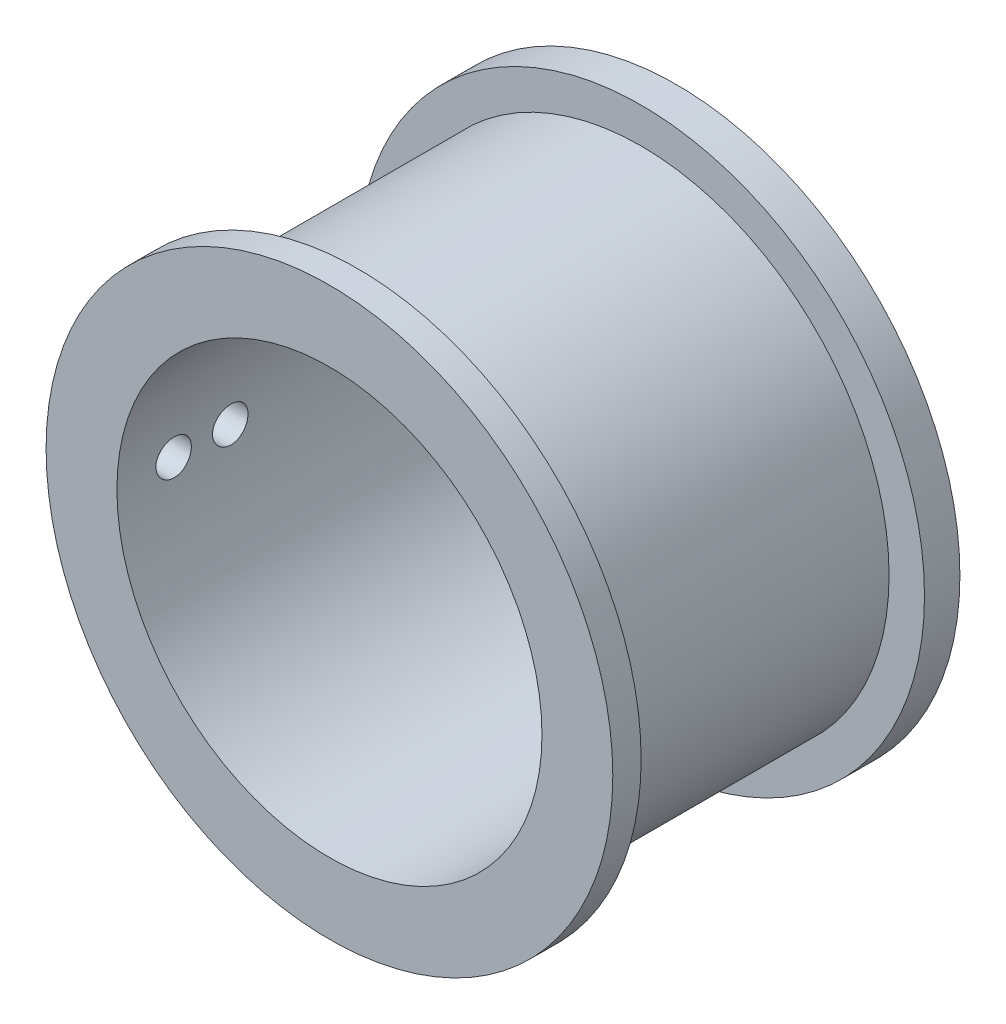
ISO-10303-21;
HEADER;
FILE_DESCRIPTION(('STEP AP214'),'2;1');
FILE_NAME('part.step','',(''),(''),'','','');
FILE_SCHEMA(('AUTOMOTIVE_DESIGN { 1 0 10303 214 1 1 1 1 }'));
ENDSEC;
DATA;
#1=APPLICATION_CONTEXT('core data for automotive mechanical design processes');
#2=APPLICATION_PROTOCOL_DEFINITION('international standard','automotive_design',2000,#1);
#3=PRODUCT_CONTEXT('',#1,'mechanical');
#4=PRODUCT('Part','Part','',(#3));
#5=PRODUCT_RELATED_PRODUCT_CATEGORY('part','',(#4));
#6=PRODUCT_DEFINITION_FORMATION('','',#4);
#7=PRODUCT_DEFINITION_CONTEXT('part definition',#1,'design');
#8=PRODUCT_DEFINITION('design','',#6,#7);
#9=PRODUCT_DEFINITION_SHAPE('','',#8);
#10=(LENGTH_UNIT() NAMED_UNIT(*) SI_UNIT(.MILLI.,.METRE.));
#11=(NAMED_UNIT(*) PLANE_ANGLE_UNIT() SI_UNIT($,.RADIAN.));
#12=(NAMED_UNIT(*) SI_UNIT($,.STERADIAN.) SOLID_ANGLE_UNIT());
#13=UNCERTAINTY_MEASURE_WITH_UNIT(LENGTH_MEASURE(1.E-05),#10,'distance_accuracy_value','');
#14=(GEOMETRIC_REPRESENTATION_CONTEXT(3) GLOBAL_UNCERTAINTY_ASSIGNED_CONTEXT((#13)) GLOBAL_UNIT_ASSIGNED_CONTEXT((#10,
#11,#12)) REPRESENTATION_CONTEXT('',''));
#15=CARTESIAN_POINT('',(0.,0.,0.));
#16=DIRECTION('',(0.,0.,1.));
#17=DIRECTION('',(1.,0.,0.));
#18=AXIS2_PLACEMENT_3D('',#15,#16,#17);
#19=CARTESIAN_POINT('',(0.,0.,3.175));
#20=DIRECTION('',(0.,0.,1.));
#21=DIRECTION('',(1.,0.,0.));
#22=AXIS2_PLACEMENT_3D('',#19,#20,#21);
#23=PLANE('',#22);
#24=CARTESIAN_POINT('',(6.9290692556793,4.00049999999998,3.175));
#25=DIRECTION('',(0.,0.,1.));
#26=DIRECTION('',(1.,0.,0.));
#27=AXIS2_PLACEMENT_3D('',#24,#25,#26);
#28=CIRCLE('',#27,1.7);
#29=CARTESIAN_POINT('',(8.6290692556793,4.00049999999998,3.175));
#30=VERTEX_POINT('',#29);
#31=EDGE_CURVE('E144',#30,#30,#28,.T.);
#32=ORIENTED_EDGE('',*,*,#31,.F.);
#33=EDGE_LOOP('',(#32));
#34=FACE_BOUND('',#33,.T.);
#35=CARTESIAN_POINT('',(-6.9290692556793,-4.00049999999998,3.175));
#36=DIRECTION('',(0.,0.,1.));
#37=DIRECTION('',(1.,0.,0.));
#38=AXIS2_PLACEMENT_3D('',#35,#36,#37);
#39=CIRCLE('',#38,1.7);
#40=CARTESIAN_POINT('',(-5.2290692556793,-4.00049999999998,3.175));
#41=VERTEX_POINT('',#40);
#42=EDGE_CURVE('E148',#41,#41,#39,.T.);
#43=ORIENTED_EDGE('',*,*,#42,.F.);
#44=EDGE_LOOP('',(#43));
#45=FACE_BOUND('',#44,.T.);
#46=CARTESIAN_POINT('',(0.,8.001,3.175));
#47=DIRECTION('',(0.,0.,1.));
#48=DIRECTION('',(1.,0.,0.));
#49=AXIS2_PLACEMENT_3D('',#46,#47,#48);
#50=CIRCLE('',#49,1.7);
#51=CARTESIAN_POINT('',(1.7,8.001,3.175));
#52=VERTEX_POINT('',#51);
#53=EDGE_CURVE('E152',#52,#52,#50,.T.);
#54=ORIENTED_EDGE('',*,*,#53,.F.);
#55=EDGE_LOOP('',(#54));
#56=FACE_BOUND('',#55,.T.);
#57=CARTESIAN_POINT('',(0.,-8.001,3.175));
#58=DIRECTION('',(0.,0.,1.));
#59=DIRECTION('',(1.,0.,0.));
#60=AXIS2_PLACEMENT_3D('',#57,#58,#59);
#61=CIRCLE('',#60,1.7);
#62=CARTESIAN_POINT('',(1.7,-8.001,3.175));
#63=VERTEX_POINT('',#62);
#64=EDGE_CURVE('E156',#63,#63,#61,.T.);
#65=ORIENTED_EDGE('',*,*,#64,.F.);
#66=EDGE_LOOP('',(#65));
#67=FACE_BOUND('',#66,.T.);
#68=CARTESIAN_POINT('',(-6.9290692556793,4.00049999999998,3.175));
#69=DIRECTION('',(0.,0.,1.));
#70=DIRECTION('',(1.,0.,0.));
#71=AXIS2_PLACEMENT_3D('',#68,#69,#70);
#72=CIRCLE('',#71,1.7);
#73=CARTESIAN_POINT('',(-5.2290692556793,4.00049999999998,3.175));
#74=VERTEX_POINT('',#73);
#75=EDGE_CURVE('E160',#74,#74,#72,.T.);
#76=ORIENTED_EDGE('',*,*,#75,.F.);
#77=EDGE_LOOP('',(#76));
#78=FACE_BOUND('',#77,.T.);
#79=CARTESIAN_POINT('',(6.9290692556793,-4.00049999999998,3.175));
#80=DIRECTION('',(0.,0.,1.));
#81=DIRECTION('',(1.,0.,0.));
#82=AXIS2_PLACEMENT_3D('',#79,#80,#81);
#83=CIRCLE('',#82,1.7);
#84=CARTESIAN_POINT('',(8.6290692556793,-4.00049999999998,3.175));
#85=VERTEX_POINT('',#84);
#86=EDGE_CURVE('E164',#85,#85,#83,.T.);
#87=ORIENTED_EDGE('',*,*,#86,.F.);
#88=EDGE_LOOP('',(#87));
#89=FACE_BOUND('',#88,.T.);
#90=CARTESIAN_POINT('',(0.,0.,3.175));
#91=DIRECTION('',(0.,0.,1.));
#92=DIRECTION('',(1.,0.,0.));
#93=AXIS2_PLACEMENT_3D('',#90,#91,#92);
#94=CIRCLE('',#93,19.05);
#95=CARTESIAN_POINT('',(19.05,0.,3.175));
#96=VERTEX_POINT('',#95);
#97=EDGE_CURVE('E10',#96,#96,#94,.F.);
#98=ORIENTED_EDGE('',*,*,#97,.F.);
#99=EDGE_LOOP('',(#98));
#100=FACE_BOUND('',#99,.T.);
#101=ADVANCED_FACE('F37',(#34,#45,#56,#67,#78,#89,#100),#23,.T.);
#102=CARTESIAN_POINT('',(0.,0.,3.175));
#103=DIRECTION('',(0.,0.,1.));
#104=DIRECTION('',(1.,0.,0.));
#105=AXIS2_PLACEMENT_3D('',#102,#103,#104);
#106=CIRCLE('',#105,22.225);
#107=CARTESIAN_POINT('',(22.225,0.,3.175));
#108=VERTEX_POINT('',#107);
#109=EDGE_CURVE('E217',#108,#108,#106,.T.);
#110=ORIENTED_EDGE('',*,*,#109,.F.);
#111=EDGE_LOOP('',(#110));
#112=FACE_BOUND('',#111,.T.);
#113=CARTESIAN_POINT('',(0.,0.,3.175));
#114=DIRECTION('',(0.,0.,1.));
#115=DIRECTION('',(1.,0.,0.));
#116=AXIS2_PLACEMENT_3D('',#113,#114,#115);
#117=CIRCLE('',#116,25.4);
#118=CARTESIAN_POINT('',(25.4,0.,3.175));
#119=VERTEX_POINT('',#118);
#120=EDGE_CURVE('E51',#119,#119,#117,.T.);
#121=ORIENTED_EDGE('',*,*,#120,.T.);
#122=EDGE_LOOP('',(#121));
#123=FACE_BOUND('',#122,.T.);
#124=ADVANCED_FACE('F125',(#112,#123),#23,.T.);
#125=CARTESIAN_POINT('',(0.,0.,0.));
#126=DIRECTION('',(0.,0.,1.));
#127=DIRECTION('',(1.,0.,0.));
#128=AXIS2_PLACEMENT_3D('',#125,#126,#127);
#129=PLANE('',#128);
#130=CARTESIAN_POINT('',(0.,0.,0.));
#131=DIRECTION('',(0.,0.,1.));
#132=DIRECTION('',(1.,0.,0.));
#133=AXIS2_PLACEMENT_3D('',#130,#131,#132);
#134=CIRCLE('',#133,25.4);
#135=CARTESIAN_POINT('',(25.4,0.,0.));
#136=VERTEX_POINT('',#135);
#137=EDGE_CURVE('E57',#136,#136,#134,.T.);
#138=ORIENTED_EDGE('',*,*,#137,.F.);
#139=EDGE_LOOP('',(#138));
#140=FACE_BOUND('',#139,.T.);
#141=CARTESIAN_POINT('',(0.,-8.001,0.));
#142=DIRECTION('',(0.,0.,1.));
#143=DIRECTION('',(1.,0.,0.));
#144=AXIS2_PLACEMENT_3D('',#141,#142,#143);
#145=CIRCLE('',#144,1.7);
#146=CARTESIAN_POINT('',(1.7,-8.001,0.));
#147=VERTEX_POINT('',#146);
#148=EDGE_CURVE('E190',#147,#147,#145,.T.);
#149=ORIENTED_EDGE('',*,*,#148,.T.);
#150=EDGE_LOOP('',(#149));
#151=FACE_BOUND('',#150,.T.);
#152=CARTESIAN_POINT('',(0.,8.001,0.));
#153=DIRECTION('',(0.,0.,1.));
#154=DIRECTION('',(1.,0.,0.));
#155=AXIS2_PLACEMENT_3D('',#152,#153,#154);
#156=CIRCLE('',#155,1.7);
#157=CARTESIAN_POINT('',(1.7,8.001,0.));
#158=VERTEX_POINT('',#157);
#159=EDGE_CURVE('E184',#158,#158,#156,.T.);
#160=ORIENTED_EDGE('',*,*,#159,.T.);
#161=EDGE_LOOP('',(#160));
#162=FACE_BOUND('',#161,.T.);
#163=CARTESIAN_POINT('',(-6.9290692556793,4.00049999999998,0.));
#164=DIRECTION('',(0.,0.,1.));
#165=DIRECTION('',(1.,0.,0.));
#166=AXIS2_PLACEMENT_3D('',#163,#164,#165);
#167=CIRCLE('',#166,1.7);
#168=CARTESIAN_POINT('',(-5.2290692556793,4.00049999999998,0.));
#169=VERTEX_POINT('',#168);
#170=EDGE_CURVE('E180',#169,#169,#167,.T.);
#171=ORIENTED_EDGE('',*,*,#170,.T.);
#172=EDGE_LOOP('',(#171));
#173=FACE_BOUND('',#172,.T.);
#174=CARTESIAN_POINT('',(-6.9290692556793,-4.00049999999998,0.));
#175=DIRECTION('',(0.,0.,1.));
#176=DIRECTION('',(1.,0.,0.));
#177=AXIS2_PLACEMENT_3D('',#174,#175,#176);
#178=CIRCLE('',#177,1.7);
#179=CARTESIAN_POINT('',(-5.2290692556793,-4.00049999999998,0.));
#180=VERTEX_POINT('',#179);
#181=EDGE_CURVE('E166',#180,#180,#178,.T.);
#182=ORIENTED_EDGE('',*,*,#181,.T.);
#183=EDGE_LOOP('',(#182));
#184=FACE_BOUND('',#183,.T.);
#185=CARTESIAN_POINT('',(6.9290692556793,-4.00049999999998,0.));
#186=DIRECTION('',(0.,0.,1.));
#187=DIRECTION('',(1.,0.,0.));
#188=AXIS2_PLACEMENT_3D('',#185,#186,#187);
#189=CIRCLE('',#188,1.7);
#190=CARTESIAN_POINT('',(8.6290692556793,-4.00049999999998,0.));
#191=VERTEX_POINT('',#190);
#192=EDGE_CURVE('E167',#191,#191,#189,.T.);
#193=ORIENTED_EDGE('',*,*,#192,.T.);
#194=EDGE_LOOP('',(#193));
#195=FACE_BOUND('',#194,.T.);
#196=CARTESIAN_POINT('',(6.9290692556793,4.00049999999998,0.));
#197=DIRECTION('',(0.,0.,1.));
#198=DIRECTION('',(1.,0.,0.));
#199=AXIS2_PLACEMENT_3D('',#196,#197,#198);
#200=CIRCLE('',#199,1.7);
#201=CARTESIAN_POINT('',(8.6290692556793,4.00049999999998,0.));
#202=VERTEX_POINT('',#201);
#203=EDGE_CURVE('E176',#202,#202,#200,.T.);
#204=ORIENTED_EDGE('',*,*,#203,.T.);
#205=EDGE_LOOP('',(#204));
#206=FACE_BOUND('',#205,.T.);
#207=ADVANCED_FACE('F127',(#140,#151,#162,#173,#184,#195,#206),#129,.F.);
#208=CARTESIAN_POINT('',(0.,0.,3.175));
#209=DIRECTION('',(0.,0.,-1.));
#210=DIRECTION('',(-1.,0.,0.));
#211=AXIS2_PLACEMENT_3D('',#208,#209,#210);
#212=CYLINDRICAL_SURFACE('',#211,25.4);
#213=ORIENTED_EDGE('',*,*,#120,.F.);
#214=EDGE_LOOP('',(#213));
#215=FACE_BOUND('',#214,.T.);
#216=ORIENTED_EDGE('',*,*,#137,.T.);
#217=EDGE_LOOP('',(#216));
#218=FACE_BOUND('',#217,.T.);
#219=ADVANCED_FACE('F39',(#215,#218),#212,.T.);
#220=CARTESIAN_POINT('',(0.,-8.001,3.175));
#221=DIRECTION('',(0.,0.,-1.));
#222=DIRECTION('',(-1.,0.,0.));
#223=AXIS2_PLACEMENT_3D('',#220,#221,#222);
#224=CYLINDRICAL_SURFACE('',#223,1.7);
#225=ORIENTED_EDGE('',*,*,#64,.T.);
#226=EDGE_LOOP('',(#225));
#227=FACE_BOUND('',#226,.T.);
#228=ORIENTED_EDGE('',*,*,#148,.F.);
#229=EDGE_LOOP('',(#228));
#230=FACE_BOUND('',#229,.T.);
#231=ADVANCED_FACE('F120',(#227,#230),#224,.F.);
#232=CARTESIAN_POINT('',(0.,8.001,3.175));
#233=DIRECTION('',(0.,0.,-1.));
#234=DIRECTION('',(-1.,0.,0.));
#235=AXIS2_PLACEMENT_3D('',#232,#233,#234);
#236=CYLINDRICAL_SURFACE('',#235,1.7);
#237=ORIENTED_EDGE('',*,*,#53,.T.);
#238=EDGE_LOOP('',(#237));
#239=FACE_BOUND('',#238,.T.);
#240=ORIENTED_EDGE('',*,*,#159,.F.);
#241=EDGE_LOOP('',(#240));
#242=FACE_BOUND('',#241,.T.);
#243=ADVANCED_FACE('F116',(#239,#242),#236,.F.);
#244=CARTESIAN_POINT('',(-6.9290692556793,4.00049999999998,3.175));
#245=DIRECTION('',(0.,0.,-1.));
#246=DIRECTION('',(-1.,0.,0.));
#247=AXIS2_PLACEMENT_3D('',#244,#245,#246);
#248=CYLINDRICAL_SURFACE('',#247,1.7);
#249=ORIENTED_EDGE('',*,*,#75,.T.);
#250=EDGE_LOOP('',(#249));
#251=FACE_BOUND('',#250,.T.);
#252=ORIENTED_EDGE('',*,*,#170,.F.);
#253=EDGE_LOOP('',(#252));
#254=FACE_BOUND('',#253,.T.);
#255=ADVANCED_FACE('F112',(#251,#254),#248,.F.);
#256=CARTESIAN_POINT('',(-6.9290692556793,-4.00049999999998,3.175));
#257=DIRECTION('',(0.,0.,-1.));
#258=DIRECTION('',(-1.,0.,0.));
#259=AXIS2_PLACEMENT_3D('',#256,#257,#258);
#260=CYLINDRICAL_SURFACE('',#259,1.7);
#261=ORIENTED_EDGE('',*,*,#42,.T.);
#262=EDGE_LOOP('',(#261));
#263=FACE_BOUND('',#262,.T.);
#264=ORIENTED_EDGE('',*,*,#181,.F.);
#265=EDGE_LOOP('',(#264));
#266=FACE_BOUND('',#265,.T.);
#267=ADVANCED_FACE('F108',(#263,#266),#260,.F.);
#268=CARTESIAN_POINT('',(6.9290692556793,-4.00049999999998,3.175));
#269=DIRECTION('',(0.,0.,-1.));
#270=DIRECTION('',(-1.,0.,0.));
#271=AXIS2_PLACEMENT_3D('',#268,#269,#270);
#272=CYLINDRICAL_SURFACE('',#271,1.7);
#273=ORIENTED_EDGE('',*,*,#86,.T.);
#274=EDGE_LOOP('',(#273));
#275=FACE_BOUND('',#274,.T.);
#276=ORIENTED_EDGE('',*,*,#192,.F.);
#277=EDGE_LOOP('',(#276));
#278=FACE_BOUND('',#277,.T.);
#279=ADVANCED_FACE('F104',(#275,#278),#272,.F.);
#280=CARTESIAN_POINT('',(6.9290692556793,4.00049999999998,3.175));
#281=DIRECTION('',(0.,0.,-1.));
#282=DIRECTION('',(-1.,0.,0.));
#283=AXIS2_PLACEMENT_3D('',#280,#281,#282);
#284=CYLINDRICAL_SURFACE('',#283,1.7);
#285=ORIENTED_EDGE('',*,*,#31,.T.);
#286=EDGE_LOOP('',(#285));
#287=FACE_BOUND('',#286,.T.);
#288=ORIENTED_EDGE('',*,*,#203,.F.);
#289=EDGE_LOOP('',(#288));
#290=FACE_BOUND('',#289,.T.);
#291=ADVANCED_FACE('F99',(#287,#290),#284,.F.);
#292=CARTESIAN_POINT('',(0.,0.,28.575));
#293=DIRECTION('',(0.,0.,-1.));
#294=DIRECTION('',(-1.,0.,0.));
#295=AXIS2_PLACEMENT_3D('',#292,#293,#294);
#296=CYLINDRICAL_SURFACE('',#295,22.225);
#297=CARTESIAN_POINT('',(-22.225,0.,27.6225));
#298=CARTESIAN_POINT('',(-22.2249992505102,-0.0890487798453089,27.6224960926458));
#299=CARTESIAN_POINT('',(-22.2244590967661,-0.178159230469293,27.6149821964167));
#300=CARTESIAN_POINT('',(-22.2223562476493,-0.353917635489169,27.5851167219226));
#301=CARTESIAN_POINT('',(-22.2207923746226,-0.440562633778051,27.5627480547727));
#302=CARTESIAN_POINT('',(-22.2168189279091,-0.608818958371993,27.5038205294595));
#303=CARTESIAN_POINT('',(-22.2144098131927,-0.690432988297742,27.4672693713209));
#304=CARTESIAN_POINT('',(-22.209016530152,-0.846346733612158,27.3810274245732));
#305=CARTESIAN_POINT('',(-22.2060324901352,-0.920648075413186,27.3313395667964));
#306=CARTESIAN_POINT('',(-22.1998181704503,-1.05998999170469,27.2201313413965));
#307=CARTESIAN_POINT('',(-22.1965874829864,-1.12501469630088,27.1585911101791));
#308=CARTESIAN_POINT('',(-22.1902474420535,-1.24382158914945,27.0254665174089));
#309=CARTESIAN_POINT('',(-22.1871380937593,-1.29760329834654,26.9538817280826));
#310=CARTESIAN_POINT('',(-22.1813881326419,-1.39244884206195,26.8026070772073));
#311=CARTESIAN_POINT('',(-22.1787480209346,-1.43349911461229,26.7229086919518));
#312=CARTESIAN_POINT('',(-22.1742396816116,-1.50162982074141,26.5577287983218));
#313=CARTESIAN_POINT('',(-22.1723714436044,-1.52871044238852,26.4722473678197));
#314=CARTESIAN_POINT('',(-22.1696215072539,-1.56808808720031,26.2980839043891));
#315=CARTESIAN_POINT('',(-22.1687381162285,-1.58041047843729,26.2094076342377));
#316=CARTESIAN_POINT('',(-22.1680524315257,-1.59000021081583,26.0312413079651));
#317=CARTESIAN_POINT('',(-22.1682501224418,-1.58726776650482,25.9417512634593));
#318=CARTESIAN_POINT('',(-22.1697027374792,-1.56684640404739,25.7646709246919));
#319=CARTESIAN_POINT('',(-22.1709557179102,-1.54918498269757,25.677077441264));
#320=CARTESIAN_POINT('',(-22.1743746638034,-1.49944968680589,25.5061014652207));
#321=CARTESIAN_POINT('',(-22.1765406360985,-1.46737570439986,25.422719004126));
#322=CARTESIAN_POINT('',(-22.1815437306027,-1.38969470144194,25.2624439285844));
#323=CARTESIAN_POINT('',(-22.1843814682512,-1.34407526138188,25.1855573535276));
#324=CARTESIAN_POINT('',(-22.1904077269116,-1.24060729011334,25.0405226080751));
#325=CARTESIAN_POINT('',(-22.1935962531125,-1.18275857799096,24.9723745669769));
#326=CARTESIAN_POINT('',(-22.1999734282712,-1.05631956294509,24.846591422183));
#327=CARTESIAN_POINT('',(-22.2031620614841,-0.987705473474694,24.7889802255534));
#328=CARTESIAN_POINT('',(-22.2091732949878,-0.841766632911349,24.6860907172361));
#329=CARTESIAN_POINT('',(-22.2119958951105,-0.764441877818128,24.6408124112122));
#330=CARTESIAN_POINT('',(-22.2169573533996,-0.603261759910867,24.5638757803873));
#331=CARTESIAN_POINT('',(-22.2190961630752,-0.519405934472627,24.5322184214555));
#332=CARTESIAN_POINT('',(-22.2224484329266,-0.347550767268372,24.4834385923502));
#333=CARTESIAN_POINT('',(-22.2236619072117,-0.259551488702715,24.4663159005543));
#334=CARTESIAN_POINT('',(-22.225024960202,-0.082114735300856,24.4471212171862));
#335=CARTESIAN_POINT('',(-22.2251768744895,0.00731914806021176,24.4450161844219));
#336=CARTESIAN_POINT('',(-22.2244059124829,0.185268660784769,24.455830153181));
#337=CARTESIAN_POINT('',(-22.2234830435218,0.273784296409173,24.4687490521983));
#338=CARTESIAN_POINT('',(-22.2206678673679,0.447291156480126,24.5092167954341));
#339=CARTESIAN_POINT('',(-22.2187765688341,0.532285948667426,24.5367504189099));
#340=CARTESIAN_POINT('',(-22.2142371838267,0.696448708516851,24.6056505405384));
#341=CARTESIAN_POINT('',(-22.211589088494,0.775616607956296,24.6470172006201));
#342=CARTESIAN_POINT('',(-22.2058275571246,0.926029235370726,24.7424928352527));
#343=CARTESIAN_POINT('',(-22.2027133211846,0.997259969190532,24.796623807242));
#344=CARTESIAN_POINT('',(-22.1963724429854,1.12963525884952,24.9160595638461));
#345=CARTESIAN_POINT('',(-22.1931457992889,1.19077968566527,24.9813644913757));
#346=CARTESIAN_POINT('',(-22.1869369396489,1.30135918063972,25.1214372734177));
#347=CARTESIAN_POINT('',(-22.1839551786465,1.35077276342893,25.1962221123391));
#348=CARTESIAN_POINT('',(-22.1785796677168,1.43634079979409,25.3530468181748));
#349=CARTESIAN_POINT('',(-22.1761859132699,1.47249535528282,25.4350866293192));
#350=CARTESIAN_POINT('',(-22.1722596801863,1.53048207282299,25.6040149404468));
#351=CARTESIAN_POINT('',(-22.1707263973451,1.55232761141386,25.6908988293214));
#352=CARTESIAN_POINT('',(-22.1686918130773,1.58111981510362,25.8671126695796));
#353=CARTESIAN_POINT('',(-22.1681904976567,1.58806668223351,25.9564425877778));
#354=CARTESIAN_POINT('',(-22.1682767293873,1.58686226608573,26.1347991718701));
#355=CARTESIAN_POINT('',(-22.1688618412033,1.57874475114551,26.2238260689349));
#356=CARTESIAN_POINT('',(-22.1710498314045,1.54771216948498,26.3992490827776));
#357=CARTESIAN_POINT('',(-22.1726527115328,1.52479707742354,26.4856451950501));
#358=CARTESIAN_POINT('',(-22.1766950052155,1.4648278320358,26.6533580326041));
#359=CARTESIAN_POINT('',(-22.1791343985534,1.4277740204065,26.7346748805833));
#360=CARTESIAN_POINT('',(-22.1845748411356,1.34058334626266,26.8899384123));
#361=CARTESIAN_POINT('',(-22.1875758780985,1.29044676981646,26.9638852571414));
#362=CARTESIAN_POINT('',(-22.1938093700963,1.17838765718373,27.1024818456295));
#363=CARTESIAN_POINT('',(-22.1970423018232,1.11644038266148,27.1671115658127));
#364=CARTESIAN_POINT('',(-22.2033710565752,0.982557854313678,27.285078896988));
#365=CARTESIAN_POINT('',(-22.2064668460125,0.910620171371233,27.3384137537042));
#366=CARTESIAN_POINT('',(-22.2121766171986,0.758694924433824,27.4323291326344));
#367=CARTESIAN_POINT('',(-22.2147898793735,0.678695608697477,27.4728906690397));
#368=CARTESIAN_POINT('',(-22.2192310743367,0.513060219064309,27.5399554155878));
#369=CARTESIAN_POINT('',(-22.2210599197177,0.427430829765419,27.5664749706847));
#370=CARTESIAN_POINT('',(-22.2232507898786,0.284403979128164,27.5978647131332));
#371=CARTESIAN_POINT('',(-22.2239038006581,0.227929277558053,27.6070908696232));
#372=CARTESIAN_POINT('',(-22.2247786459001,0.1143115224029,27.6194097615889));
#373=CARTESIAN_POINT('',(-22.2250004811653,0.0571684700624514,27.6225025084843));
#374=CARTESIAN_POINT('',(-22.225,0.,27.6225));
#375=B_SPLINE_CURVE_WITH_KNOTS('',3,(#297,#298,#299,#300,#301,#302,#303,#304,#305,#306,#307,
#308,#309,#310,#311,#312,#313,#314,#315,#316,#317,#318,#319,#320,#321,#322,#323,#324,#325,#326,
#327,#328,#329,#330,#331,#332,#333,#334,#335,#336,#337,#338,#339,#340,#341,#342,#343,#344,#345,
#346,#347,#348,#349,#350,#351,#352,#353,#354,#355,#356,#357,#358,#359,#360,#361,#362,#363,#364,
#365,#366,#367,#368,#369,#370,#371,#372,#373,#374),.UNSPECIFIED.,.T.,.F.,(4,2,2,2,2,2,2,2,2,2,2,
2,2,2,2,2,2,2,2,2,2,2,2,2,2,2,2,2,2,2,2,2,2,2,2,2,2,2,4),(0.,0.266937629617517,
0.534182876696857,0.80128323229163,1.068324047305,1.33581635740701,1.60332006282591,
1.87110775144002,2.13889183483147,2.40621495777004,2.67353427107931,2.94036229494986,
3.20719231580489,3.47426774622428,3.74134712790406,4.00902516602319,4.27670332707101,
4.54440046620517,4.81209352345948,5.07919743208777,5.34629951831526,5.61312397097007,
5.87995154717375,6.14724236669449,6.41453660511805,6.68231668736601,6.95009471133459,
7.2176220489735,7.48514575882866,7.75207051143201,8.01899572115038,8.28591448037192,
8.55282740362441,8.82030566186748,9.08784907032422,9.35578828905127,9.62341493539106,
9.79478667487047,9.96615809527443),.UNSPECIFIED.);
#376=CARTESIAN_POINT('',(-22.225,0.,27.6225));
#377=VERTEX_POINT('',#376);
#378=EDGE_CURVE('E90',#377,#377,#375,.T.);
#379=ORIENTED_EDGE('',*,*,#378,.T.);
#380=EDGE_LOOP('',(#379));
#381=FACE_BOUND('',#380,.T.);
#382=CARTESIAN_POINT('',(-22.225,0.,22.5425));
#383=CARTESIAN_POINT('',(-22.2249992505102,-0.08904877984531,22.5424960926457));
#384=CARTESIAN_POINT('',(-22.2244590967661,-0.178159230469295,22.5349821964167));
#385=CARTESIAN_POINT('',(-22.2223562476493,-0.353917635489172,22.5051167219226));
#386=CARTESIAN_POINT('',(-22.2207923746226,-0.440562633778054,22.4827480547727));
#387=CARTESIAN_POINT('',(-22.2168189279091,-0.608818958371997,22.4238205294594));
#388=CARTESIAN_POINT('',(-22.2144098131927,-0.690432988297746,22.3872693713209));
#389=CARTESIAN_POINT('',(-22.209016530152,-0.846346733612163,22.3010274245732));
#390=CARTESIAN_POINT('',(-22.2060324901352,-0.920648075413194,22.2513395667964));
#391=CARTESIAN_POINT('',(-22.1998181704503,-1.05998999170469,22.1401313413965));
#392=CARTESIAN_POINT('',(-22.1965874829864,-1.12501469630089,22.078591110179));
#393=CARTESIAN_POINT('',(-22.1902474420535,-1.24382158914945,21.9454665174089));
#394=CARTESIAN_POINT('',(-22.1871380937593,-1.29760329834655,21.8738817280826));
#395=CARTESIAN_POINT('',(-22.1813881326419,-1.39244884206196,21.7226070772073));
#396=CARTESIAN_POINT('',(-22.1787480209346,-1.4334991146123,21.6429086919518));
#397=CARTESIAN_POINT('',(-22.1742396816116,-1.50162982074142,21.4777287983217));
#398=CARTESIAN_POINT('',(-22.1723714436044,-1.52871044238854,21.3922473678197));
#399=CARTESIAN_POINT('',(-22.1696215072539,-1.56808808720032,21.2180839043891));
#400=CARTESIAN_POINT('',(-22.1687381162285,-1.58041047843731,21.1294076342377));
#401=CARTESIAN_POINT('',(-22.1680524315257,-1.59000021081585,20.9512413079651));
#402=CARTESIAN_POINT('',(-22.1682501224418,-1.58726776650484,20.8617512634593));
#403=CARTESIAN_POINT('',(-22.1697027374792,-1.5668464040474,20.6846709246919));
#404=CARTESIAN_POINT('',(-22.1709557179102,-1.54918498269758,20.5970774412639));
#405=CARTESIAN_POINT('',(-22.1743746638034,-1.4994496868059,20.4261014652206));
#406=CARTESIAN_POINT('',(-22.1765406360985,-1.46737570439988,20.342719004126));
#407=CARTESIAN_POINT('',(-22.1815437306027,-1.38969470144195,20.1824439285844));
#408=CARTESIAN_POINT('',(-22.1843814682512,-1.34407526138189,20.1055573535276));
#409=CARTESIAN_POINT('',(-22.1904077269116,-1.24060729011335,19.960522608075));
#410=CARTESIAN_POINT('',(-22.1935962531125,-1.18275857799097,19.8923745669768));
#411=CARTESIAN_POINT('',(-22.1999734282712,-1.05631956294511,19.766591422183));
#412=CARTESIAN_POINT('',(-22.2031620614841,-0.987705473474705,19.7089802255534));
#413=CARTESIAN_POINT('',(-22.2091732949878,-0.841766632911358,19.6060907172361));
#414=CARTESIAN_POINT('',(-22.2119958951105,-0.764441877818136,19.5608124112122));
#415=CARTESIAN_POINT('',(-22.2169573533996,-0.603261759910873,19.4838757803872));
#416=CARTESIAN_POINT('',(-22.2190961630752,-0.519405934472633,19.4522184214554));
#417=CARTESIAN_POINT('',(-22.2224484329266,-0.347550767268378,19.4034385923502));
#418=CARTESIAN_POINT('',(-22.2236619072117,-0.25955148870272,19.3863159005543));
#419=CARTESIAN_POINT('',(-22.225024960202,-0.0821147353008586,19.3671212171862));
#420=CARTESIAN_POINT('',(-22.2251768744895,0.00731914806021017,19.3650161844219));
#421=CARTESIAN_POINT('',(-22.2244059124829,0.185268660784769,19.375830153181));
#422=CARTESIAN_POINT('',(-22.2234830435218,0.273784296409174,19.3887490521983));
#423=CARTESIAN_POINT('',(-22.2206678673679,0.447291156480129,19.429216795434));
#424=CARTESIAN_POINT('',(-22.2187765688341,0.532285948667431,19.4567504189099));
#425=CARTESIAN_POINT('',(-22.2142371838267,0.696448708516858,19.5256505405383));
#426=CARTESIAN_POINT('',(-22.211589088494,0.775616607956303,19.56701720062));
#427=CARTESIAN_POINT('',(-22.2058275571246,0.926029235370734,19.6624928352527));
#428=CARTESIAN_POINT('',(-22.2027133211846,0.997259969190541,19.7166238072419));
#429=CARTESIAN_POINT('',(-22.1963724429854,1.12963525884953,19.836059563846));
#430=CARTESIAN_POINT('',(-22.1931457992889,1.19077968566528,19.9013644913756));
#431=CARTESIAN_POINT('',(-22.1869369396489,1.30135918063973,20.0414372734177));
#432=CARTESIAN_POINT('',(-22.1839551786465,1.35077276342894,20.116222112339));
#433=CARTESIAN_POINT('',(-22.1785796677168,1.43634079979411,20.2730468181747));
#434=CARTESIAN_POINT('',(-22.1761859132699,1.47249535528283,20.3550866293192));
#435=CARTESIAN_POINT('',(-22.1722596801863,1.53048207282301,20.5240149404468));
#436=CARTESIAN_POINT('',(-22.1707263973451,1.55232761141387,20.6108988293213));
#437=CARTESIAN_POINT('',(-22.1686918130773,1.58111981510363,20.7871126695796));
#438=CARTESIAN_POINT('',(-22.1681904976567,1.58806668223353,20.8764425877777));
#439=CARTESIAN_POINT('',(-22.1682767293873,1.58686226608574,21.0547991718701));
#440=CARTESIAN_POINT('',(-22.1688618412033,1.57874475114553,21.1438260689348));
#441=CARTESIAN_POINT('',(-22.1710498314045,1.547712169485,21.3192490827776));
#442=CARTESIAN_POINT('',(-22.1726527115328,1.52479707742355,21.4056451950501));
#443=CARTESIAN_POINT('',(-22.1766950052155,1.46482783203581,21.5733580326041));
#444=CARTESIAN_POINT('',(-22.1791343985534,1.42777402040651,21.6546748805833));
#445=CARTESIAN_POINT('',(-22.1845748411356,1.34058334626267,21.8099384122999));
#446=CARTESIAN_POINT('',(-22.1875758780985,1.29044676981647,21.8838852571414));
#447=CARTESIAN_POINT('',(-22.1938093700963,1.17838765718374,22.0224818456295));
#448=CARTESIAN_POINT('',(-22.1970423018232,1.11644038266148,22.0871115658127));
#449=CARTESIAN_POINT('',(-22.2033710565751,0.982557854313687,22.205078896988));
#450=CARTESIAN_POINT('',(-22.2064668460125,0.910620171371242,22.2584137537042));
#451=CARTESIAN_POINT('',(-22.2121766171986,0.758694924433832,22.3523291326344));
#452=CARTESIAN_POINT('',(-22.2147898793735,0.678695608697484,22.3928906690397));
#453=CARTESIAN_POINT('',(-22.2192310743367,0.513060219064314,22.4599554155878));
#454=CARTESIAN_POINT('',(-22.2210599197177,0.427430829765424,22.4864749706846));
#455=CARTESIAN_POINT('',(-22.2232507898786,0.284403979128169,22.5178647131332));
#456=CARTESIAN_POINT('',(-22.2239038006581,0.227929277558057,22.5270908696232));
#457=CARTESIAN_POINT('',(-22.2247786459001,0.114311522402902,22.5394097615889));
#458=CARTESIAN_POINT('',(-22.2250004811653,0.0571684700624524,22.5425025084843));
#459=CARTESIAN_POINT('',(-22.225,0.,22.5425));
#460=B_SPLINE_CURVE_WITH_KNOTS('',3,(#382,#383,#384,#385,#386,#387,#388,#389,#390,#391,#392,
#393,#394,#395,#396,#397,#398,#399,#400,#401,#402,#403,#404,#405,#406,#407,#408,#409,#410,#411,
#412,#413,#414,#415,#416,#417,#418,#419,#420,#421,#422,#423,#424,#425,#426,#427,#428,#429,#430,
#431,#432,#433,#434,#435,#436,#437,#438,#439,#440,#441,#442,#443,#444,#445,#446,#447,#448,#449,
#450,#451,#452,#453,#454,#455,#456,#457,#458,#459),.UNSPECIFIED.,.T.,.F.,(4,2,2,2,2,2,2,2,2,2,2,
2,2,2,2,2,2,2,2,2,2,2,2,2,2,2,2,2,2,2,2,2,2,2,2,2,2,2,4),(0.,0.26693762961752,0.534182876696862,
0.801283232291634,1.06832404730501,1.33581635740702,1.60332006282592,1.87110775144004,
2.13889183483149,2.40621495777005,2.67353427107934,2.94036229494989,3.20719231580492,
3.47426774622431,3.74134712790409,4.00902516602322,4.27670332707105,4.54440046620521,
4.81209352345952,5.07919743208782,5.34629951831531,5.61312397097013,5.8799515471738,
6.14724236669455,6.41453660511811,6.68231668736606,6.95009471133465,7.21762204897357,
7.48514575882873,7.75207051143208,8.01899572115045,8.28591448037199,8.55282740362449,
8.82030566186757,9.0878490703243,9.35578828905136,9.62341493539115,9.79478667487056,
9.96615809527453),.UNSPECIFIED.);
#461=CARTESIAN_POINT('',(-22.225,0.,22.5425));
#462=VERTEX_POINT('',#461);
#463=EDGE_CURVE('E67',#462,#462,#460,.T.);
#464=ORIENTED_EDGE('',*,*,#463,.T.);
#465=EDGE_LOOP('',(#464));
#466=FACE_BOUND('',#465,.T.);
#467=CARTESIAN_POINT('',(0.,0.,28.575));
#468=DIRECTION('',(0.,0.,1.));
#469=DIRECTION('',(1.,0.,0.));
#470=AXIS2_PLACEMENT_3D('',#467,#468,#469);
#471=CIRCLE('',#470,22.225);
#472=CARTESIAN_POINT('',(22.225,0.,28.575));
#473=VERTEX_POINT('',#472);
#474=EDGE_CURVE('E213',#473,#473,#471,.T.);
#475=ORIENTED_EDGE('',*,*,#474,.F.);
#476=EDGE_LOOP('',(#475));
#477=FACE_BOUND('',#476,.T.);
#478=ORIENTED_EDGE('',*,*,#109,.T.);
#479=EDGE_LOOP('',(#478));
#480=FACE_BOUND('',#479,.T.);
#481=ADVANCED_FACE('F95',(#381,#466,#477,#480),#296,.T.);
#482=CARTESIAN_POINT('',(0.,0.,28.575));
#483=DIRECTION('',(0.,0.,-1.));
#484=DIRECTION('',(-1.,0.,0.));
#485=AXIS2_PLACEMENT_3D('',#482,#483,#484);
#486=CYLINDRICAL_SURFACE('',#485,19.05);
#487=CARTESIAN_POINT('',(-19.05,0.,27.6225));
#488=CARTESIAN_POINT('',(-19.0499991334078,-0.089004917749911,27.6224961124883));
#489=CARTESIAN_POINT('',(-19.0493695806264,-0.178070426148607,27.614989585425));
#490=CARTESIAN_POINT('',(-19.046918699461,-0.353737180986865,27.5851550914301));
#491=CARTESIAN_POINT('',(-19.0450960209157,-0.440335519545049,27.562810332891));
#492=CARTESIAN_POINT('',(-19.0404648597819,-0.608498310741384,27.5039500183276));
#493=CARTESIAN_POINT('',(-19.0376569350635,-0.690065581424071,27.4674424803757));
#494=CARTESIAN_POINT('',(-19.0313701754473,-0.845894983048013,27.3813072644032));
#495=CARTESIAN_POINT('',(-19.0278914841041,-0.920158671943046,27.3316823928545));
#496=CARTESIAN_POINT('',(-19.0206436303841,-1.05948162494537,27.220584581763));
#497=CARTESIAN_POINT('',(-19.0168738293744,-1.12451970996065,27.1590851217521));
#498=CARTESIAN_POINT('',(-19.0094739952503,-1.24336354948927,27.0260399028382));
#499=CARTESIAN_POINT('',(-19.0058439682818,-1.29716881055225,26.9544937028196));
#500=CARTESIAN_POINT('',(-18.9991278109972,-1.39209132679447,26.8032577391053));
#501=CARTESIAN_POINT('',(-18.996042481234,-1.43318997231056,26.7235562565481));
#502=CARTESIAN_POINT('',(-18.9907723506163,-1.50141373861596,26.5583538308049));
#503=CARTESIAN_POINT('',(-18.9885875338557,-1.52853910622595,26.4728529900876));
#504=CARTESIAN_POINT('',(-18.9853711615529,-1.56798490983697,26.2986910653887));
#505=CARTESIAN_POINT('',(-18.9843369191125,-1.58033984380625,26.2100378452618));
#506=CARTESIAN_POINT('',(-18.9835303006034,-1.59000064272448,26.0319104012368));
#507=CARTESIAN_POINT('',(-18.9837579008528,-1.587306790105,25.9424361927782));
#508=CARTESIAN_POINT('',(-18.985446810616,-1.56697499694106,25.7654430310021));
#509=CARTESIAN_POINT('',(-18.9869050248734,-1.5493745492604,25.6779197370912));
#510=CARTESIAN_POINT('',(-18.9908860016637,-1.4997874267954,25.5070739105137));
#511=CARTESIAN_POINT('',(-18.9934087745936,-1.46780061150488,25.4237514188835));
#512=CARTESIAN_POINT('',(-18.9992381747213,-1.39030676369134,25.2635529369186));
#513=CARTESIAN_POINT('',(-19.0025457761216,-1.34478290980203,25.1866851205799));
#514=CARTESIAN_POINT('',(-19.0095712464641,-1.24151936721243,25.0416673746236));
#515=CARTESIAN_POINT('',(-19.0132891237145,-1.18377943111327,24.9735176216082));
#516=CARTESIAN_POINT('',(-19.0207299990349,-1.05751246178434,24.8476525218906));
#517=CARTESIAN_POINT('',(-19.0244529780542,-0.988953015407528,24.7899696856949));
#518=CARTESIAN_POINT('',(-19.0314737459336,-0.843106258240145,24.6869271891207));
#519=CARTESIAN_POINT('',(-19.0347715345097,-0.765818941618089,24.641567536976));
#520=CARTESIAN_POINT('',(-19.040570977228,-0.604689216812706,24.5644610267635));
#521=CARTESIAN_POINT('',(-19.0430725471519,-0.520846116371898,24.532715608591));
#522=CARTESIAN_POINT('',(-19.0469967264123,-0.348994522068581,24.4837614647336));
#523=CARTESIAN_POINT('',(-19.0484193581411,-0.260986114693053,24.4665524373598));
#524=CARTESIAN_POINT('',(-19.0500224939709,-0.0835839390107454,24.447200337084));
#525=CARTESIAN_POINT('',(-19.0502067003105,0.00580489872037586,24.4450123587553));
#526=CARTESIAN_POINT('',(-19.0493221181119,0.183678119598994,24.4556468287459));
#527=CARTESIAN_POINT('',(-19.0482533412612,0.272162511175242,24.4684691370518));
#528=CARTESIAN_POINT('',(-19.044985370731,0.445587050506708,24.5087229830436));
#529=CARTESIAN_POINT('',(-19.0427877877516,0.530532062409306,24.536133706441));
#530=CARTESIAN_POINT('',(-19.0375090755336,0.694617237068447,24.604765033104));
#531=CARTESIAN_POINT('',(-19.034427932326,0.773757308024467,24.6459858547079));
#532=CARTESIAN_POINT('',(-19.0277182689989,0.92419045905427,24.741180116881));
#533=CARTESIAN_POINT('',(-19.0240884792224,0.995464656452825,24.7951833064018));
#534=CARTESIAN_POINT('',(-19.0166935934052,1.12795223806424,24.9143663780677));
#535=CARTESIAN_POINT('',(-19.0129284950145,1.18916544744282,24.9795464543983));
#536=CARTESIAN_POINT('',(-19.0056763843012,1.29994746590996,25.1194279363649));
#537=CARTESIAN_POINT('',(-19.0021900860033,1.34948697150839,25.1941525916509));
#538=CARTESIAN_POINT('',(-18.9959004089411,1.43531441225772,25.3508863422957));
#539=CARTESIAN_POINT('',(-18.9930970233584,1.4716024797158,25.4328953649146));
#540=CARTESIAN_POINT('',(-18.9884945802269,1.52984704418688,25.6017661549811));
#541=CARTESIAN_POINT('',(-18.9866942660046,1.55182147955073,25.688621699734));
#542=CARTESIAN_POINT('',(-18.9842975928423,1.58087340973235,25.8648052360507));
#543=CARTESIAN_POINT('',(-18.9837012107819,1.58795119062711,25.9541331801008));
#544=CARTESIAN_POINT('',(-18.9837802624593,1.58700559358934,26.1324346000582));
#545=CARTESIAN_POINT('',(-18.9844518185025,1.57902825827159,26.2214083254879));
#546=CARTESIAN_POINT('',(-18.9869828394316,1.54829488298084,26.396747647012));
#547=CARTESIAN_POINT('',(-18.9888423061294,1.52553882046759,26.4831132391284));
#548=CARTESIAN_POINT('',(-18.9935386119658,1.46590561215207,26.6507876991858));
#549=CARTESIAN_POINT('',(-18.9963753937333,1.42902929523535,26.7320968636231));
#550=CARTESIAN_POINT('',(-19.0027067855167,1.34220753107874,26.8873777094107));
#551=CARTESIAN_POINT('',(-19.0062013852074,1.29226228896935,26.9613495059037));
#552=CARTESIAN_POINT('',(-19.0134673657166,1.18054745811937,27.1000914356832));
#553=CARTESIAN_POINT('',(-19.0172395245912,1.11874378381455,27.1648340824936));
#554=CARTESIAN_POINT('',(-19.0246284957787,0.985128245628026,27.2830531065103));
#555=CARTESIAN_POINT('',(-19.0282452702816,0.913313963692721,27.3365267538374));
#556=CARTESIAN_POINT('',(-19.0349224781211,0.761577364684186,27.4307615284129));
#557=CARTESIAN_POINT('',(-19.0379818633668,0.681640204329471,27.4714988076169));
#558=CARTESIAN_POINT('',(-19.0431872836963,0.51608950629322,27.5389209873439));
#559=CARTESIAN_POINT('',(-19.0453343681111,0.430482621719165,27.5656220408074));
#560=CARTESIAN_POINT('',(-19.0479220852749,0.286975626353474,27.597413662222));
#561=CARTESIAN_POINT('',(-19.0486977559216,0.229998419921069,27.6068085348715));
#562=CARTESIAN_POINT('',(-19.0497369934558,0.115355959758094,27.6193529553626));
#563=CARTESIAN_POINT('',(-19.0500005617029,0.0576907078547081,27.6225025197855));
#564=CARTESIAN_POINT('',(-19.05,0.,27.6225));
#565=B_SPLINE_CURVE_WITH_KNOTS('',3,(#487,#488,#489,#490,#491,#492,#493,#494,#495,#496,#497,
#498,#499,#500,#501,#502,#503,#504,#505,#506,#507,#508,#509,#510,#511,#512,#513,#514,#515,#516,
#517,#518,#519,#520,#521,#522,#523,#524,#525,#526,#527,#528,#529,#530,#531,#532,#533,#534,#535,
#536,#537,#538,#539,#540,#541,#542,#543,#544,#545,#546,#547,#548,#549,#550,#551,#552,#553,#554,
#555,#556,#557,#558,#559,#560,#561,#562,#563,#564),.UNSPECIFIED.,.T.,.F.,(4,2,2,2,2,2,2,2,2,2,2,
2,2,2,2,2,2,2,2,2,2,2,2,2,2,2,2,2,2,2,2,2,2,2,2,2,2,2,4),(0.,0.266804119045219,
0.533910681284058,0.800866244798707,1.06776473896488,1.33526636169739,1.60277973312365,
1.87068305934856,2.13858165323041,2.40585331045141,2.67311995160655,2.93971635687582,
3.20631536594732,3.47324705001374,3.74018414047111,4.00793665859546,4.27568935561844,
4.54347036424836,4.81124581520395,5.07822040150125,5.34519249752571,5.61178470336366,
5.87838112423673,6.1456042152269,6.41283194938104,6.68072350179777,6.9486123794147,
7.21616487994967,7.48371224233021,7.75044269826005,8.01717356100332,8.28388876854185,
8.55059978995638,8.81808924505106,9.08564342431554,9.35369562236795,9.6214386658945,
9.79437472091191,9.96731031677999),.UNSPECIFIED.);
#566=CARTESIAN_POINT('',(-19.05,0.,27.6225));
#567=VERTEX_POINT('',#566);
#568=EDGE_CURVE('E41',#567,#567,#565,.T.);
#569=ORIENTED_EDGE('',*,*,#568,.F.);
#570=EDGE_LOOP('',(#569));
#571=FACE_BOUND('',#570,.T.);
#572=CARTESIAN_POINT('',(-19.05,0.,22.5425));
#573=CARTESIAN_POINT('',(-19.0499991334078,-0.0890049177499117,22.5424961124883));
#574=CARTESIAN_POINT('',(-19.0493695806264,-0.178070426148608,22.534989585425));
#575=CARTESIAN_POINT('',(-19.046918699461,-0.353737180986868,22.5051550914301));
#576=CARTESIAN_POINT('',(-19.0450960209157,-0.440335519545053,22.482810332891));
#577=CARTESIAN_POINT('',(-19.0404648597819,-0.608498310741388,22.4239500183276));
#578=CARTESIAN_POINT('',(-19.0376569350635,-0.690065581424076,22.3874424803757));
#579=CARTESIAN_POINT('',(-19.0313701754473,-0.845894983048019,22.3013072644032));
#580=CARTESIAN_POINT('',(-19.0278914841041,-0.920158671943053,22.2516823928545));
#581=CARTESIAN_POINT('',(-19.0206436303841,-1.05948162494537,22.140584581763));
#582=CARTESIAN_POINT('',(-19.0168738293744,-1.12451970996066,22.0790851217521));
#583=CARTESIAN_POINT('',(-19.0094739952503,-1.24336354948928,21.9460399028382));
#584=CARTESIAN_POINT('',(-19.0058439682818,-1.29716881055226,21.8744937028196));
#585=CARTESIAN_POINT('',(-18.9991278109972,-1.39209132679449,21.7232577391053));
#586=CARTESIAN_POINT('',(-18.996042481234,-1.43318997231057,21.6435562565481));
#587=CARTESIAN_POINT('',(-18.9907723506163,-1.50141373861598,21.4783538308049));
#588=CARTESIAN_POINT('',(-18.9885875338557,-1.52853910622596,21.3928529900875));
#589=CARTESIAN_POINT('',(-18.9853711615529,-1.56798490983698,21.2186910653886));
#590=CARTESIAN_POINT('',(-18.9843369191125,-1.58033984380627,21.1300378452617));
#591=CARTESIAN_POINT('',(-18.9835303006034,-1.59000064272449,20.9519104012367));
#592=CARTESIAN_POINT('',(-18.9837579008528,-1.58730679010502,20.8624361927782));
#593=CARTESIAN_POINT('',(-18.985446810616,-1.56697499694107,20.685443031002));
#594=CARTESIAN_POINT('',(-18.9869050248734,-1.54937454926041,20.5979197370912));
#595=CARTESIAN_POINT('',(-18.9908860016637,-1.49978742679542,20.4270739105137));
#596=CARTESIAN_POINT('',(-18.9934087745936,-1.46780061150489,20.3437514188835));
#597=CARTESIAN_POINT('',(-18.9992381747213,-1.39030676369135,20.1835529369185));
#598=CARTESIAN_POINT('',(-19.0025457761216,-1.34478290980205,20.1066851205798));
#599=CARTESIAN_POINT('',(-19.0095712464641,-1.24151936721244,19.9616673746236));
#600=CARTESIAN_POINT('',(-19.0132891237145,-1.18377943111329,19.8935176216082));
#601=CARTESIAN_POINT('',(-19.0207299990349,-1.05751246178435,19.7676525218905));
#602=CARTESIAN_POINT('',(-19.0244529780542,-0.988953015407539,19.7099696856948));
#603=CARTESIAN_POINT('',(-19.0314737459336,-0.843106258240155,19.6069271891207));
#604=CARTESIAN_POINT('',(-19.0347715345097,-0.765818941618097,19.561567536976));
#605=CARTESIAN_POINT('',(-19.040570977228,-0.604689216812712,19.4844610267634));
#606=CARTESIAN_POINT('',(-19.0430725471519,-0.520846116371905,19.4527156085909));
#607=CARTESIAN_POINT('',(-19.0469967264123,-0.348994522068587,19.4037614647335));
#608=CARTESIAN_POINT('',(-19.0484193581411,-0.260986114693058,19.3865524373598));
#609=CARTESIAN_POINT('',(-19.0500224939709,-0.0835839390107487,19.367200337084));
#610=CARTESIAN_POINT('',(-19.0502067003105,0.00580489872037323,19.3650123587553));
#611=CARTESIAN_POINT('',(-19.0493221181119,0.183678119598994,19.3756468287459));
#612=CARTESIAN_POINT('',(-19.0482533412612,0.272162511175243,19.3884691370518));
#613=CARTESIAN_POINT('',(-19.044985370731,0.44558705050671,19.4287229830435));
#614=CARTESIAN_POINT('',(-19.0427877877516,0.530532062409309,19.456133706441));
#615=CARTESIAN_POINT('',(-19.0375090755336,0.694617237068451,19.524765033104));
#616=CARTESIAN_POINT('',(-19.034427932326,0.773757308024472,19.5659858547079));
#617=CARTESIAN_POINT('',(-19.0277182689989,0.924190459054277,19.661180116881));
#618=CARTESIAN_POINT('',(-19.0240884792224,0.995464656452833,19.7151833064018));
#619=CARTESIAN_POINT('',(-19.0166935934052,1.12795223806425,19.8343663780676));
#620=CARTESIAN_POINT('',(-19.0129284950145,1.18916544744283,19.8995464543982));
#621=CARTESIAN_POINT('',(-19.0056763843012,1.29994746590997,20.0394279363649));
#622=CARTESIAN_POINT('',(-19.0021900860033,1.3494869715084,20.1141525916509));
#623=CARTESIAN_POINT('',(-18.9959004089411,1.43531441225773,20.2708863422957));
#624=CARTESIAN_POINT('',(-18.9930970233584,1.47160247971582,20.3528953649145));
#625=CARTESIAN_POINT('',(-18.9884945802269,1.5298470441869,20.521766154981));
#626=CARTESIAN_POINT('',(-18.9866942660046,1.55182147955075,20.608621699734));
#627=CARTESIAN_POINT('',(-18.9842975928423,1.58087340973237,20.7848052360506));
#628=CARTESIAN_POINT('',(-18.9837012107819,1.58795119062712,20.8741331801007));
#629=CARTESIAN_POINT('',(-18.9837802624593,1.58700559358935,21.0524346000582));
#630=CARTESIAN_POINT('',(-18.9844518185025,1.57902825827161,21.1414083254878));
#631=CARTESIAN_POINT('',(-18.9869828394316,1.54829488298086,21.316747647012));
#632=CARTESIAN_POINT('',(-18.9888423061294,1.52553882046761,21.4031132391283));
#633=CARTESIAN_POINT('',(-18.9935386119658,1.46590561215209,21.5707876991858));
#634=CARTESIAN_POINT('',(-18.9963753937333,1.42902929523537,21.652096863623));
#635=CARTESIAN_POINT('',(-19.0027067855167,1.34220753107876,21.8073777094107));
#636=CARTESIAN_POINT('',(-19.0062013852074,1.29226228896936,21.8813495059036));
#637=CARTESIAN_POINT('',(-19.0134673657166,1.18054745811939,22.0200914356832));
#638=CARTESIAN_POINT('',(-19.0172395245912,1.11874378381457,22.0848340824935));
#639=CARTESIAN_POINT('',(-19.0246284957787,0.98512824562804,22.2030531065103));
#640=CARTESIAN_POINT('',(-19.0282452702816,0.913313963692733,22.2565267538374));
#641=CARTESIAN_POINT('',(-19.0349224781211,0.761577364684195,22.3507615284129));
#642=CARTESIAN_POINT('',(-19.0379818633668,0.681640204329479,22.3914988076169));
#643=CARTESIAN_POINT('',(-19.0431872836963,0.516089506293226,22.4589209873439));
#644=CARTESIAN_POINT('',(-19.0453343681111,0.43048262171917,22.4856220408074));
#645=CARTESIAN_POINT('',(-19.0479220852749,0.286975626353478,22.517413662222));
#646=CARTESIAN_POINT('',(-19.0486977559216,0.229998419921072,22.5268085348715));
#647=CARTESIAN_POINT('',(-19.0497369934558,0.115355959758095,22.5393529553626));
#648=CARTESIAN_POINT('',(-19.0500005617029,0.0576907078547088,22.5425025197855));
#649=CARTESIAN_POINT('',(-19.05,0.,22.5425));
#650=B_SPLINE_CURVE_WITH_KNOTS('',3,(#572,#573,#574,#575,#576,#577,#578,#579,#580,#581,#582,
#583,#584,#585,#586,#587,#588,#589,#590,#591,#592,#593,#594,#595,#596,#597,#598,#599,#600,#601,
#602,#603,#604,#605,#606,#607,#608,#609,#610,#611,#612,#613,#614,#615,#616,#617,#618,#619,#620,
#621,#622,#623,#624,#625,#626,#627,#628,#629,#630,#631,#632,#633,#634,#635,#636,#637,#638,#639,
#640,#641,#642,#643,#644,#645,#646,#647,#648,#649),.UNSPECIFIED.,.T.,.F.,(4,2,2,2,2,2,2,2,2,2,2,
2,2,2,2,2,2,2,2,2,2,2,2,2,2,2,2,2,2,2,2,2,2,2,2,2,2,2,4),(0.,0.266804119045221,
0.533910681284062,0.800866244798713,1.06776473896489,1.3352663616974,1.60277973312366,
1.87068305934857,2.13858165323042,2.40585331045143,2.67311995160657,2.93971635687585,
3.20631536594735,3.47324705001376,3.74018414047115,4.00793665859549,4.27568935561848,
4.54347036424839,4.81124581520399,5.07822040150129,5.34519249752575,5.61178470336371,
5.87838112423678,6.14560421522696,6.4128319493811,6.68072350179783,6.94861237941476,
7.21616487994973,7.48371224233028,7.75044269826012,8.01717356100339,8.28388876854191,
8.55059978995646,8.81808924505113,9.08564342431562,9.35369562236803,9.62143866589459,
9.794374720912,9.96731031678008),.UNSPECIFIED.);
#651=CARTESIAN_POINT('',(-19.05,0.,22.5425));
#652=VERTEX_POINT('',#651);
#653=EDGE_CURVE('E60',#652,#652,#650,.T.);
#654=ORIENTED_EDGE('',*,*,#653,.F.);
#655=EDGE_LOOP('',(#654));
#656=FACE_BOUND('',#655,.T.);
#657=ORIENTED_EDGE('',*,*,#97,.T.);
#658=EDGE_LOOP('',(#657));
#659=FACE_BOUND('',#658,.T.);
#660=CARTESIAN_POINT('',(0.,0.,31.115));
#661=DIRECTION('',(0.,0.,1.));
#662=DIRECTION('',(1.,0.,0.));
#663=AXIS2_PLACEMENT_3D('',#660,#661,#662);
#664=CIRCLE('',#663,19.05);
#665=CARTESIAN_POINT('',(19.05,0.,31.115));
#666=VERTEX_POINT('',#665);
#667=EDGE_CURVE('E230',#666,#666,#664,.T.);
#668=ORIENTED_EDGE('',*,*,#667,.T.);
#669=EDGE_LOOP('',(#668));
#670=FACE_BOUND('',#669,.T.);
#671=ADVANCED_FACE('F68',(#571,#656,#659,#670),#486,.F.);
#672=CARTESIAN_POINT('',(0.,0.,31.115));
#673=DIRECTION('',(0.,0.,1.));
#674=DIRECTION('',(1.,0.,0.));
#675=AXIS2_PLACEMENT_3D('',#672,#673,#674);
#676=PLANE('',#675);
#677=CARTESIAN_POINT('',(0.,0.,31.115));
#678=DIRECTION('',(0.,0.,1.));
#679=DIRECTION('',(1.,0.,0.));
#680=AXIS2_PLACEMENT_3D('',#677,#678,#679);
#681=CIRCLE('',#680,25.4);
#682=CARTESIAN_POINT('',(25.4,0.,31.115));
#683=VERTEX_POINT('',#682);
#684=EDGE_CURVE('E223',#683,#683,#681,.T.);
#685=ORIENTED_EDGE('',*,*,#684,.T.);
#686=EDGE_LOOP('',(#685));
#687=FACE_BOUND('',#686,.T.);
#688=ORIENTED_EDGE('',*,*,#667,.F.);
#689=EDGE_LOOP('',(#688));
#690=FACE_BOUND('',#689,.T.);
#691=ADVANCED_FACE('F80',(#687,#690),#676,.T.);
#692=CARTESIAN_POINT('',(0.,0.,28.575));
#693=DIRECTION('',(0.,0.,1.));
#694=DIRECTION('',(1.,0.,0.));
#695=AXIS2_PLACEMENT_3D('',#692,#693,#694);
#696=PLANE('',#695);
#697=ORIENTED_EDGE('',*,*,#474,.T.);
#698=EDGE_LOOP('',(#697));
#699=FACE_BOUND('',#698,.T.);
#700=CARTESIAN_POINT('',(0.,0.,28.575));
#701=DIRECTION('',(0.,0.,1.));
#702=DIRECTION('',(1.,0.,0.));
#703=AXIS2_PLACEMENT_3D('',#700,#701,#702);
#704=CIRCLE('',#703,25.4);
#705=CARTESIAN_POINT('',(25.4,0.,28.575));
#706=VERTEX_POINT('',#705);
#707=EDGE_CURVE('E226',#706,#706,#704,.T.);
#708=ORIENTED_EDGE('',*,*,#707,.F.);
#709=EDGE_LOOP('',(#708));
#710=FACE_BOUND('',#709,.T.);
#711=ADVANCED_FACE('F263',(#699,#710),#696,.F.);
#712=CARTESIAN_POINT('',(0.,0.,31.115));
#713=DIRECTION('',(0.,0.,-1.));
#714=DIRECTION('',(-1.,0.,0.));
#715=AXIS2_PLACEMENT_3D('',#712,#713,#714);
#716=CYLINDRICAL_SURFACE('',#715,25.4);
#717=ORIENTED_EDGE('',*,*,#684,.F.);
#718=EDGE_LOOP('',(#717));
#719=FACE_BOUND('',#718,.T.);
#720=ORIENTED_EDGE('',*,*,#707,.T.);
#721=EDGE_LOOP('',(#720));
#722=FACE_BOUND('',#721,.T.);
#723=ADVANCED_FACE('F77',(#719,#722),#716,.T.);
#724=CARTESIAN_POINT('',(-25.4,0.,20.955));
#725=DIRECTION('',(1.,0.,0.));
#726=DIRECTION('',(0.,0.,-1.));
#727=AXIS2_PLACEMENT_3D('',#724,#725,#726);
#728=CYLINDRICAL_SURFACE('',#727,1.5875);
#729=ORIENTED_EDGE('',*,*,#653,.T.);
#730=EDGE_LOOP('',(#729));
#731=FACE_BOUND('',#730,.T.);
#732=ORIENTED_EDGE('',*,*,#463,.F.);
#733=EDGE_LOOP('',(#732));
#734=FACE_BOUND('',#733,.T.);
#735=ADVANCED_FACE('F72',(#731,#734),#728,.F.);
#736=CARTESIAN_POINT('',(-25.4,0.,26.035));
#737=DIRECTION('',(1.,0.,0.));
#738=DIRECTION('',(0.,0.,-1.));
#739=AXIS2_PLACEMENT_3D('',#736,#737,#738);
#740=CYLINDRICAL_SURFACE('',#739,1.58749999999998);
#741=ORIENTED_EDGE('',*,*,#568,.T.);
#742=EDGE_LOOP('',(#741));
#743=FACE_BOUND('',#742,.T.);
#744=ORIENTED_EDGE('',*,*,#378,.F.);
#745=EDGE_LOOP('',(#744));
#746=FACE_BOUND('',#745,.T.);
#747=ADVANCED_FACE('F76',(#743,#746),#740,.F.);
#748=CLOSED_SHELL('',(#101,#124,#207,#219,#231,#243,#255,#267,#279,#291,#481,#671,#691,#711,
#723,#735,#747));
#749=MANIFOLD_SOLID_BREP('B2',#748);
#750=ADVANCED_BREP_SHAPE_REPRESENTATION('',(#18,#749),#14);
#751=SHAPE_DEFINITION_REPRESENTATION(#9,#750);
ENDSEC;
END-ISO-10303-21;
